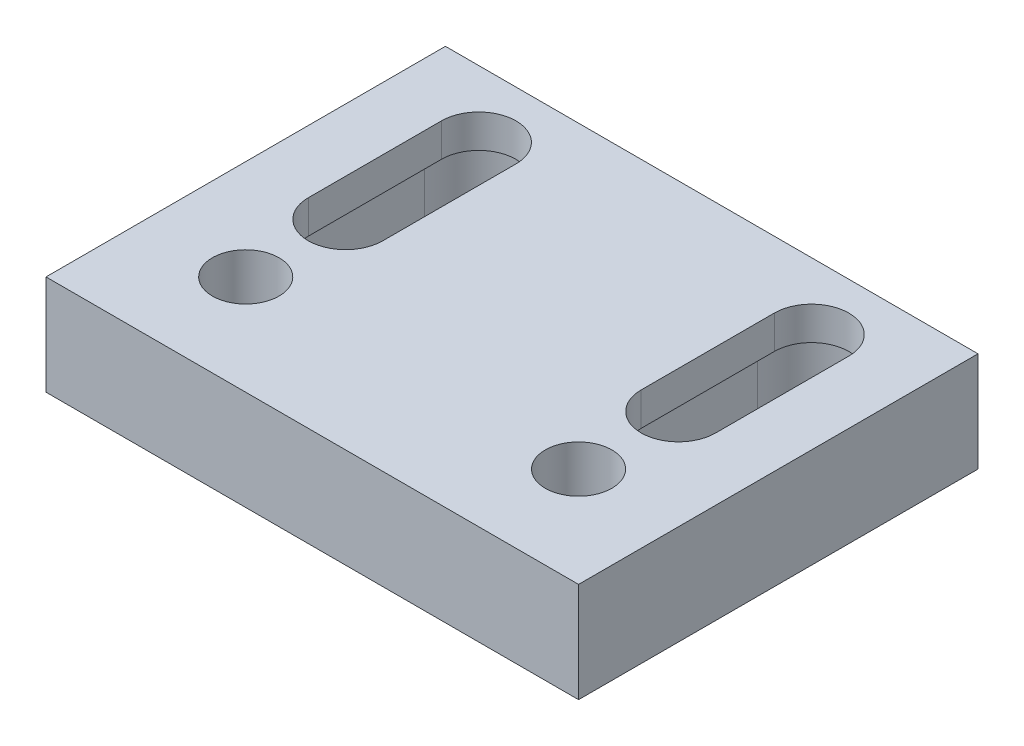
ISO-10303-21;
HEADER;
FILE_DESCRIPTION(('STEP AP214'),'2;1');
FILE_NAME('part.step','',(''),(''),'','','');
FILE_SCHEMA(('AUTOMOTIVE_DESIGN { 1 0 10303 214 1 1 1 1 }'));
ENDSEC;
DATA;
#1=APPLICATION_CONTEXT('core data for automotive mechanical design processes');
#2=APPLICATION_PROTOCOL_DEFINITION('international standard','automotive_design',2000,#1);
#3=PRODUCT_CONTEXT('',#1,'mechanical');
#4=PRODUCT('Part','Part','',(#3));
#5=PRODUCT_RELATED_PRODUCT_CATEGORY('part','',(#4));
#6=PRODUCT_DEFINITION_FORMATION('','',#4);
#7=PRODUCT_DEFINITION_CONTEXT('part definition',#1,'design');
#8=PRODUCT_DEFINITION('design','',#6,#7);
#9=PRODUCT_DEFINITION_SHAPE('','',#8);
#10=(LENGTH_UNIT() NAMED_UNIT(*) SI_UNIT(.MILLI.,.METRE.));
#11=(NAMED_UNIT(*) PLANE_ANGLE_UNIT() SI_UNIT($,.RADIAN.));
#12=(NAMED_UNIT(*) SI_UNIT($,.STERADIAN.) SOLID_ANGLE_UNIT());
#13=UNCERTAINTY_MEASURE_WITH_UNIT(LENGTH_MEASURE(1.E-05),#10,'distance_accuracy_value','');
#14=(GEOMETRIC_REPRESENTATION_CONTEXT(3) GLOBAL_UNCERTAINTY_ASSIGNED_CONTEXT((#13)) GLOBAL_UNIT_ASSIGNED_CONTEXT((#10,
#11,#12)) REPRESENTATION_CONTEXT('',''));
#15=CARTESIAN_POINT('',(0.,0.,0.));
#16=DIRECTION('',(0.,0.,1.));
#17=DIRECTION('',(1.,0.,0.));
#18=AXIS2_PLACEMENT_3D('',#15,#16,#17);
#19=CARTESIAN_POINT('',(0.,19.05,0.));
#20=DIRECTION('',(0.,-1.,0.));
#21=DIRECTION('',(0.,0.,-1.));
#22=AXIS2_PLACEMENT_3D('',#19,#20,#21);
#23=PLANE('',#22);
#24=CARTESIAN_POINT('',(25.4,19.05,-19.05));
#25=DIRECTION('',(0.,1.,0.));
#26=DIRECTION('',(0.,0.,1.));
#27=AXIS2_PLACEMENT_3D('',#24,#25,#26);
#28=CIRCLE('',#27,6.34999999999999);
#29=CARTESIAN_POINT('',(25.4,19.05,-12.7));
#30=VERTEX_POINT('',#29);
#31=EDGE_CURVE('E294',#30,#30,#28,.T.);
#32=ORIENTED_EDGE('',*,*,#31,.F.);
#33=EDGE_LOOP('',(#32));
#34=FACE_BOUND('',#33,.T.);
#35=CARTESIAN_POINT('',(88.9,19.05,-19.05));
#36=DIRECTION('',(0.,1.,0.));
#37=DIRECTION('',(0.,0.,1.));
#38=AXIS2_PLACEMENT_3D('',#35,#36,#37);
#39=CIRCLE('',#38,6.34999999999999);
#40=CARTESIAN_POINT('',(88.9,19.05,-12.7));
#41=VERTEX_POINT('',#40);
#42=EDGE_CURVE('E300',#41,#41,#39,.T.);
#43=ORIENTED_EDGE('',*,*,#42,.F.);
#44=EDGE_LOOP('',(#43));
#45=FACE_BOUND('',#44,.T.);
#46=CARTESIAN_POINT('',(88.9,19.05,-63.5));
#47=DIRECTION('',(0.,1.,0.));
#48=DIRECTION('',(0.,0.,-1.));
#49=AXIS2_PLACEMENT_3D('',#46,#47,#48);
#50=CIRCLE('',#49,7.11200000000001);
#51=CARTESIAN_POINT('',(96.012,19.05,-63.5));
#52=VERTEX_POINT('',#51);
#53=CARTESIAN_POINT('',(81.788,19.05,-63.5));
#54=VERTEX_POINT('',#53);
#55=EDGE_CURVE('E324',#52,#54,#50,.T.);
#56=ORIENTED_EDGE('',*,*,#55,.F.);
#57=DIRECTION('',(0.,0.,-1.));
#58=VECTOR('',#57,1.);
#59=CARTESIAN_POINT('',(96.012,19.05,-63.5));
#60=LINE('',#59,#58);
#61=CARTESIAN_POINT('',(96.012,19.05,-38.1));
#62=VERTEX_POINT('',#61);
#63=EDGE_CURVE('E331',#62,#52,#60,.T.);
#64=ORIENTED_EDGE('',*,*,#63,.F.);
#65=CARTESIAN_POINT('',(88.9,19.05,-38.1));
#66=DIRECTION('',(0.,1.,0.));
#67=DIRECTION('',(0.,0.,-1.));
#68=AXIS2_PLACEMENT_3D('',#65,#66,#67);
#69=CIRCLE('',#68,7.11200000000001);
#70=CARTESIAN_POINT('',(81.788,19.05,-38.1));
#71=VERTEX_POINT('',#70);
#72=EDGE_CURVE('E328',#71,#62,#69,.T.);
#73=ORIENTED_EDGE('',*,*,#72,.F.);
#74=DIRECTION('',(0.,0.,1.));
#75=VECTOR('',#74,1.);
#76=CARTESIAN_POINT('',(81.788,19.05,-63.5));
#77=LINE('',#76,#75);
#78=EDGE_CURVE('E326',#54,#71,#77,.T.);
#79=ORIENTED_EDGE('',*,*,#78,.F.);
#80=EDGE_LOOP('',(#56,#64,#73,#79));
#81=FACE_BOUND('',#80,.T.);
#82=CARTESIAN_POINT('',(25.4,19.05,-63.5));
#83=DIRECTION('',(0.,1.,0.));
#84=DIRECTION('',(0.,0.,1.));
#85=AXIS2_PLACEMENT_3D('',#82,#83,#84);
#86=CIRCLE('',#85,7.11200000000002);
#87=CARTESIAN_POINT('',(32.512,19.05,-63.5));
#88=VERTEX_POINT('',#87);
#89=CARTESIAN_POINT('',(18.288,19.05,-63.5));
#90=VERTEX_POINT('',#89);
#91=EDGE_CURVE('E303',#88,#90,#86,.T.);
#92=ORIENTED_EDGE('',*,*,#91,.F.);
#93=DIRECTION('',(0.,0.,-1.));
#94=VECTOR('',#93,1.);
#95=CARTESIAN_POINT('',(32.512,19.05,-63.5));
#96=LINE('',#95,#94);
#97=CARTESIAN_POINT('',(32.512,19.05,-38.1));
#98=VERTEX_POINT('',#97);
#99=EDGE_CURVE('E310',#98,#88,#96,.T.);
#100=ORIENTED_EDGE('',*,*,#99,.F.);
#101=CARTESIAN_POINT('',(25.4,19.05,-38.1));
#102=DIRECTION('',(0.,1.,0.));
#103=DIRECTION('',(0.,0.,1.));
#104=AXIS2_PLACEMENT_3D('',#101,#102,#103);
#105=CIRCLE('',#104,7.11200000000002);
#106=CARTESIAN_POINT('',(18.288,19.05,-38.1));
#107=VERTEX_POINT('',#106);
#108=EDGE_CURVE('E307',#107,#98,#105,.T.);
#109=ORIENTED_EDGE('',*,*,#108,.F.);
#110=DIRECTION('',(0.,0.,1.));
#111=VECTOR('',#110,1.);
#112=CARTESIAN_POINT('',(18.288,19.05,-63.5));
#113=LINE('',#112,#111);
#114=EDGE_CURVE('E305',#90,#107,#113,.T.);
#115=ORIENTED_EDGE('',*,*,#114,.F.);
#116=EDGE_LOOP('',(#92,#100,#109,#115));
#117=FACE_BOUND('',#116,.T.);
#118=DIRECTION('',(0.,0.,-1.));
#119=VECTOR('',#118,1.);
#120=CARTESIAN_POINT('',(6.35,19.05,0.));
#121=LINE('',#120,#119);
#122=CARTESIAN_POINT('',(6.35,19.05,0.));
#123=VERTEX_POINT('',#122);
#124=CARTESIAN_POINT('',(6.35,19.05,-76.2));
#125=VERTEX_POINT('',#124);
#126=EDGE_CURVE('E68',#123,#125,#121,.T.);
#127=ORIENTED_EDGE('',*,*,#126,.F.);
#128=DIRECTION('',(1.,0.,0.));
#129=VECTOR('',#128,1.);
#130=CARTESIAN_POINT('',(0.,19.05,0.));
#131=LINE('',#130,#129);
#132=CARTESIAN_POINT('',(107.95,19.05,0.));
#133=VERTEX_POINT('',#132);
#134=EDGE_CURVE('E189',#123,#133,#131,.T.);
#135=ORIENTED_EDGE('',*,*,#134,.T.);
#136=DIRECTION('',(0.,0.,1.));
#137=VECTOR('',#136,1.);
#138=CARTESIAN_POINT('',(107.95,19.05,0.));
#139=LINE('',#138,#137);
#140=CARTESIAN_POINT('',(107.95,19.05,-76.2));
#141=VERTEX_POINT('',#140);
#142=EDGE_CURVE('E203',#141,#133,#139,.T.);
#143=ORIENTED_EDGE('',*,*,#142,.F.);
#144=DIRECTION('',(-1.,0.,0.));
#145=VECTOR('',#144,1.);
#146=CARTESIAN_POINT('',(0.,19.05,-76.2));
#147=LINE('',#146,#145);
#148=EDGE_CURVE('E346',#141,#125,#147,.T.);
#149=ORIENTED_EDGE('',*,*,#148,.T.);
#150=EDGE_LOOP('',(#127,#135,#143,#149));
#151=FACE_BOUND('',#150,.T.);
#152=ADVANCED_FACE('F45',(#34,#45,#81,#117,#151),#23,.F.);
#153=CARTESIAN_POINT('',(0.,0.,0.));
#154=DIRECTION('',(0.,-1.,0.));
#155=DIRECTION('',(0.,0.,-1.));
#156=AXIS2_PLACEMENT_3D('',#153,#154,#155);
#157=PLANE('',#156);
#158=CARTESIAN_POINT('',(88.9,0.,-38.1));
#159=DIRECTION('',(0.,-1.,0.));
#160=DIRECTION('',(0.,0.,-1.));
#161=AXIS2_PLACEMENT_3D('',#158,#159,#160);
#162=CIRCLE('',#161,10.3251);
#163=CARTESIAN_POINT('',(99.2251000000001,0.,-38.1));
#164=VERTEX_POINT('',#163);
#165=CARTESIAN_POINT('',(78.5749,0.,-38.1));
#166=VERTEX_POINT('',#165);
#167=EDGE_CURVE('E209',#164,#166,#162,.T.);
#168=ORIENTED_EDGE('',*,*,#167,.F.);
#169=DIRECTION('',(0.,0.,1.));
#170=VECTOR('',#169,1.);
#171=CARTESIAN_POINT('',(99.2251000000001,0.,-38.1));
#172=LINE('',#171,#170);
#173=CARTESIAN_POINT('',(99.2251000000001,0.,-63.5));
#174=VERTEX_POINT('',#173);
#175=EDGE_CURVE('E214',#174,#164,#172,.T.);
#176=ORIENTED_EDGE('',*,*,#175,.F.);
#177=CARTESIAN_POINT('',(88.9,0.,-63.5));
#178=DIRECTION('',(0.,-1.,0.));
#179=DIRECTION('',(0.,0.,-1.));
#180=AXIS2_PLACEMENT_3D('',#177,#178,#179);
#181=CIRCLE('',#180,10.3251);
#182=CARTESIAN_POINT('',(78.5749,0.,-63.5));
#183=VERTEX_POINT('',#182);
#184=EDGE_CURVE('E228',#183,#174,#181,.T.);
#185=ORIENTED_EDGE('',*,*,#184,.F.);
#186=DIRECTION('',(0.,0.,-1.));
#187=VECTOR('',#186,1.);
#188=CARTESIAN_POINT('',(78.5749,0.,-63.5));
#189=LINE('',#188,#187);
#190=EDGE_CURVE('E225',#166,#183,#189,.T.);
#191=ORIENTED_EDGE('',*,*,#190,.F.);
#192=EDGE_LOOP('',(#168,#176,#185,#191));
#193=FACE_BOUND('',#192,.T.);
#194=CARTESIAN_POINT('',(25.4,0.,-63.5));
#195=DIRECTION('',(0.,-1.,0.));
#196=DIRECTION('',(0.,0.,-1.));
#197=AXIS2_PLACEMENT_3D('',#194,#195,#196);
#198=CIRCLE('',#197,10.3251);
#199=CARTESIAN_POINT('',(15.0749,0.,-63.5));
#200=VERTEX_POINT('',#199);
#201=CARTESIAN_POINT('',(35.7251,0.,-63.5));
#202=VERTEX_POINT('',#201);
#203=EDGE_CURVE('E250',#200,#202,#198,.T.);
#204=ORIENTED_EDGE('',*,*,#203,.F.);
#205=DIRECTION('',(0.,0.,-1.));
#206=VECTOR('',#205,1.);
#207=CARTESIAN_POINT('',(15.0749,0.,-63.5));
#208=LINE('',#207,#206);
#209=CARTESIAN_POINT('',(15.0749,0.,-38.1));
#210=VERTEX_POINT('',#209);
#211=EDGE_CURVE('E255',#210,#200,#208,.T.);
#212=ORIENTED_EDGE('',*,*,#211,.F.);
#213=CARTESIAN_POINT('',(25.4,0.,-38.1));
#214=DIRECTION('',(0.,-1.,0.));
#215=DIRECTION('',(0.,0.,-1.));
#216=AXIS2_PLACEMENT_3D('',#213,#214,#215);
#217=CIRCLE('',#216,10.3251);
#218=CARTESIAN_POINT('',(35.7251,0.,-38.1));
#219=VERTEX_POINT('',#218);
#220=EDGE_CURVE('E269',#219,#210,#217,.T.);
#221=ORIENTED_EDGE('',*,*,#220,.F.);
#222=DIRECTION('',(0.,0.,1.));
#223=VECTOR('',#222,1.);
#224=CARTESIAN_POINT('',(35.7251,0.,-38.1));
#225=LINE('',#224,#223);
#226=EDGE_CURVE('E266',#202,#219,#225,.T.);
#227=ORIENTED_EDGE('',*,*,#226,.F.);
#228=EDGE_LOOP('',(#204,#212,#221,#227));
#229=FACE_BOUND('',#228,.T.);
#230=CARTESIAN_POINT('',(25.4,0.,-19.05));
#231=DIRECTION('',(0.,1.,0.));
#232=DIRECTION('',(0.,0.,1.));
#233=AXIS2_PLACEMENT_3D('',#230,#231,#232);
#234=CIRCLE('',#233,6.34999999999999);
#235=CARTESIAN_POINT('',(25.4,0.,-12.7));
#236=VERTEX_POINT('',#235);
#237=EDGE_CURVE('E291',#236,#236,#234,.T.);
#238=ORIENTED_EDGE('',*,*,#237,.T.);
#239=EDGE_LOOP('',(#238));
#240=FACE_BOUND('',#239,.T.);
#241=CARTESIAN_POINT('',(88.9,0.,-19.05));
#242=DIRECTION('',(0.,1.,0.));
#243=DIRECTION('',(0.,0.,1.));
#244=AXIS2_PLACEMENT_3D('',#241,#242,#243);
#245=CIRCLE('',#244,6.34999999999998);
#246=CARTESIAN_POINT('',(88.9,0.,-12.7));
#247=VERTEX_POINT('',#246);
#248=EDGE_CURVE('E297',#247,#247,#245,.T.);
#249=ORIENTED_EDGE('',*,*,#248,.T.);
#250=EDGE_LOOP('',(#249));
#251=FACE_BOUND('',#250,.T.);
#252=DIRECTION('',(1.,0.,0.));
#253=VECTOR('',#252,1.);
#254=CARTESIAN_POINT('',(0.,0.,0.));
#255=LINE('',#254,#253);
#256=CARTESIAN_POINT('',(6.35,0.,0.));
#257=VERTEX_POINT('',#256);
#258=CARTESIAN_POINT('',(107.95,0.,0.));
#259=VERTEX_POINT('',#258);
#260=EDGE_CURVE('E190',#257,#259,#255,.T.);
#261=ORIENTED_EDGE('',*,*,#260,.F.);
#262=DIRECTION('',(0.,0.,-1.));
#263=VECTOR('',#262,1.);
#264=CARTESIAN_POINT('',(6.35,0.,0.));
#265=LINE('',#264,#263);
#266=CARTESIAN_POINT('',(6.35,0.,-76.2));
#267=VERTEX_POINT('',#266);
#268=EDGE_CURVE('E193',#257,#267,#265,.T.);
#269=ORIENTED_EDGE('',*,*,#268,.T.);
#270=DIRECTION('',(-1.,0.,0.));
#271=VECTOR('',#270,1.);
#272=CARTESIAN_POINT('',(0.,0.,-76.2));
#273=LINE('',#272,#271);
#274=CARTESIAN_POINT('',(107.95,0.,-76.2));
#275=VERTEX_POINT('',#274);
#276=EDGE_CURVE('E182',#275,#267,#273,.T.);
#277=ORIENTED_EDGE('',*,*,#276,.F.);
#278=DIRECTION('',(0.,0.,1.));
#279=VECTOR('',#278,1.);
#280=CARTESIAN_POINT('',(107.95,0.,0.));
#281=LINE('',#280,#279);
#282=EDGE_CURVE('E199',#275,#259,#281,.T.);
#283=ORIENTED_EDGE('',*,*,#282,.T.);
#284=EDGE_LOOP('',(#261,#269,#277,#283));
#285=FACE_BOUND('',#284,.T.);
#286=ADVANCED_FACE('F194',(#193,#229,#240,#251,#285),#157,.T.);
#287=CARTESIAN_POINT('',(0.,19.05,0.));
#288=DIRECTION('',(0.,0.,-1.));
#289=DIRECTION('',(-1.,0.,0.));
#290=AXIS2_PLACEMENT_3D('',#287,#288,#289);
#291=PLANE('',#290);
#292=DIRECTION('',(0.,1.,0.));
#293=VECTOR('',#292,1.);
#294=CARTESIAN_POINT('',(6.35,19.05,0.));
#295=LINE('',#294,#293);
#296=EDGE_CURVE('E60',#257,#123,#295,.T.);
#297=ORIENTED_EDGE('',*,*,#296,.F.);
#298=ORIENTED_EDGE('',*,*,#260,.T.);
#299=DIRECTION('',(0.,-1.,0.));
#300=VECTOR('',#299,1.);
#301=CARTESIAN_POINT('',(107.95,19.05,0.));
#302=LINE('',#301,#300);
#303=EDGE_CURVE('E206',#133,#259,#302,.T.);
#304=ORIENTED_EDGE('',*,*,#303,.F.);
#305=ORIENTED_EDGE('',*,*,#134,.F.);
#306=EDGE_LOOP('',(#297,#298,#304,#305));
#307=FACE_BOUND('',#306,.T.);
#308=ADVANCED_FACE('F47',(#307),#291,.F.);
#309=CARTESIAN_POINT('',(0.,19.05,-76.2));
#310=DIRECTION('',(0.,0.,1.));
#311=DIRECTION('',(1.,0.,0.));
#312=AXIS2_PLACEMENT_3D('',#309,#310,#311);
#313=PLANE('',#312);
#314=DIRECTION('',(0.,-1.,0.));
#315=VECTOR('',#314,1.);
#316=CARTESIAN_POINT('',(6.35,19.05,-76.2));
#317=LINE('',#316,#315);
#318=EDGE_CURVE('E13',#125,#267,#317,.T.);
#319=ORIENTED_EDGE('',*,*,#318,.F.);
#320=ORIENTED_EDGE('',*,*,#148,.F.);
#321=DIRECTION('',(0.,1.,0.));
#322=VECTOR('',#321,1.);
#323=CARTESIAN_POINT('',(107.95,19.05,-76.2));
#324=LINE('',#323,#322);
#325=EDGE_CURVE('E53',#275,#141,#324,.T.);
#326=ORIENTED_EDGE('',*,*,#325,.F.);
#327=ORIENTED_EDGE('',*,*,#276,.T.);
#328=EDGE_LOOP('',(#319,#320,#326,#327));
#329=FACE_BOUND('',#328,.T.);
#330=ADVANCED_FACE('F184',(#329),#313,.F.);
#331=CARTESIAN_POINT('',(88.9,19.05,-63.5));
#332=DIRECTION('',(0.,-1.,0.));
#333=DIRECTION('',(0.,0.,-1.));
#334=AXIS2_PLACEMENT_3D('',#331,#332,#333);
#335=CYLINDRICAL_SURFACE('',#334,7.11200000000001);
#336=DIRECTION('',(0.,-1.,0.));
#337=VECTOR('',#336,1.);
#338=CARTESIAN_POINT('',(81.788,19.05,-63.5));
#339=LINE('',#338,#337);
#340=CARTESIAN_POINT('',(81.788,12.7,-63.5));
#341=VERTEX_POINT('',#340);
#342=EDGE_CURVE('E342',#54,#341,#339,.T.);
#343=ORIENTED_EDGE('',*,*,#342,.T.);
#344=CARTESIAN_POINT('',(88.9,12.7,-63.5));
#345=DIRECTION('',(0.,-1.,0.));
#346=DIRECTION('',(0.,0.,-1.));
#347=AXIS2_PLACEMENT_3D('',#344,#345,#346);
#348=CIRCLE('',#347,7.11200000000001);
#349=CARTESIAN_POINT('',(96.012,12.7,-63.5));
#350=VERTEX_POINT('',#349);
#351=EDGE_CURVE('E247',#341,#350,#348,.T.);
#352=ORIENTED_EDGE('',*,*,#351,.T.);
#353=DIRECTION('',(0.,-1.,0.));
#354=VECTOR('',#353,1.);
#355=CARTESIAN_POINT('',(96.012,19.05,-63.5));
#356=LINE('',#355,#354);
#357=EDGE_CURVE('E333',#52,#350,#356,.T.);
#358=ORIENTED_EDGE('',*,*,#357,.F.);
#359=ORIENTED_EDGE('',*,*,#55,.T.);
#360=EDGE_LOOP('',(#343,#352,#358,#359));
#361=FACE_BOUND('',#360,.T.);
#362=ADVANCED_FACE('F369',(#361),#335,.F.);
#363=CARTESIAN_POINT('',(81.788,19.05,-63.5));
#364=DIRECTION('',(1.,0.,0.));
#365=DIRECTION('',(0.,0.,-1.));
#366=AXIS2_PLACEMENT_3D('',#363,#364,#365);
#367=PLANE('',#366);
#368=DIRECTION('',(0.,-1.,0.));
#369=VECTOR('',#368,1.);
#370=CARTESIAN_POINT('',(81.788,19.05,-38.1));
#371=LINE('',#370,#369);
#372=CARTESIAN_POINT('',(81.788,12.7,-38.1));
#373=VERTEX_POINT('',#372);
#374=EDGE_CURVE('E339',#71,#373,#371,.T.);
#375=ORIENTED_EDGE('',*,*,#374,.T.);
#376=DIRECTION('',(0.,0.,-1.));
#377=VECTOR('',#376,1.);
#378=CARTESIAN_POINT('',(81.788,12.7,-63.5));
#379=LINE('',#378,#377);
#380=EDGE_CURVE('E244',#373,#341,#379,.T.);
#381=ORIENTED_EDGE('',*,*,#380,.T.);
#382=ORIENTED_EDGE('',*,*,#342,.F.);
#383=ORIENTED_EDGE('',*,*,#78,.T.);
#384=EDGE_LOOP('',(#375,#381,#382,#383));
#385=FACE_BOUND('',#384,.T.);
#386=ADVANCED_FACE('F376',(#385),#367,.T.);
#387=CARTESIAN_POINT('',(88.9,19.05,-38.1));
#388=DIRECTION('',(0.,-1.,0.));
#389=DIRECTION('',(0.,0.,-1.));
#390=AXIS2_PLACEMENT_3D('',#387,#388,#389);
#391=CYLINDRICAL_SURFACE('',#390,7.11200000000001);
#392=DIRECTION('',(0.,-1.,0.));
#393=VECTOR('',#392,1.);
#394=CARTESIAN_POINT('',(96.012,19.05,-38.1));
#395=LINE('',#394,#393);
#396=CARTESIAN_POINT('',(96.012,12.7,-38.1));
#397=VERTEX_POINT('',#396);
#398=EDGE_CURVE('E336',#62,#397,#395,.T.);
#399=ORIENTED_EDGE('',*,*,#398,.T.);
#400=CARTESIAN_POINT('',(88.9,12.7,-38.1));
#401=DIRECTION('',(0.,-1.,0.));
#402=DIRECTION('',(0.,0.,-1.));
#403=AXIS2_PLACEMENT_3D('',#400,#401,#402);
#404=CIRCLE('',#403,7.11200000000001);
#405=EDGE_CURVE('E235',#397,#373,#404,.T.);
#406=ORIENTED_EDGE('',*,*,#405,.T.);
#407=ORIENTED_EDGE('',*,*,#374,.F.);
#408=ORIENTED_EDGE('',*,*,#72,.T.);
#409=EDGE_LOOP('',(#399,#406,#407,#408));
#410=FACE_BOUND('',#409,.T.);
#411=ADVANCED_FACE('F463',(#410),#391,.F.);
#412=CARTESIAN_POINT('',(96.012,19.05,-63.5));
#413=DIRECTION('',(-1.,0.,0.));
#414=DIRECTION('',(0.,0.,1.));
#415=AXIS2_PLACEMENT_3D('',#412,#413,#414);
#416=PLANE('',#415);
#417=ORIENTED_EDGE('',*,*,#357,.T.);
#418=DIRECTION('',(0.,0.,1.));
#419=VECTOR('',#418,1.);
#420=CARTESIAN_POINT('',(96.012,12.7,-63.5));
#421=LINE('',#420,#419);
#422=EDGE_CURVE('E352',#350,#397,#421,.T.);
#423=ORIENTED_EDGE('',*,*,#422,.T.);
#424=ORIENTED_EDGE('',*,*,#398,.F.);
#425=ORIENTED_EDGE('',*,*,#63,.T.);
#426=EDGE_LOOP('',(#417,#423,#424,#425));
#427=FACE_BOUND('',#426,.T.);
#428=ADVANCED_FACE('F457',(#427),#416,.T.);
#429=CARTESIAN_POINT('',(25.4,19.05,-63.5));
#430=DIRECTION('',(0.,-1.,0.));
#431=DIRECTION('',(0.,0.,-1.));
#432=AXIS2_PLACEMENT_3D('',#429,#430,#431);
#433=CYLINDRICAL_SURFACE('',#432,7.11200000000002);
#434=DIRECTION('',(0.,-1.,0.));
#435=VECTOR('',#434,1.);
#436=CARTESIAN_POINT('',(18.288,19.05,-63.5));
#437=LINE('',#436,#435);
#438=CARTESIAN_POINT('',(18.288,12.7,-63.5));
#439=VERTEX_POINT('',#438);
#440=EDGE_CURVE('E321',#90,#439,#437,.T.);
#441=ORIENTED_EDGE('',*,*,#440,.T.);
#442=CARTESIAN_POINT('',(25.4,12.7,-63.5));
#443=DIRECTION('',(0.,-1.,0.));
#444=DIRECTION('',(0.,0.,-1.));
#445=AXIS2_PLACEMENT_3D('',#442,#443,#444);
#446=CIRCLE('',#445,7.11200000000002);
#447=CARTESIAN_POINT('',(32.512,12.7,-63.5));
#448=VERTEX_POINT('',#447);
#449=EDGE_CURVE('E288',#439,#448,#446,.T.);
#450=ORIENTED_EDGE('',*,*,#449,.T.);
#451=DIRECTION('',(0.,-1.,0.));
#452=VECTOR('',#451,1.);
#453=CARTESIAN_POINT('',(32.512,19.05,-63.5));
#454=LINE('',#453,#452);
#455=EDGE_CURVE('E312',#88,#448,#454,.T.);
#456=ORIENTED_EDGE('',*,*,#455,.F.);
#457=ORIENTED_EDGE('',*,*,#91,.T.);
#458=EDGE_LOOP('',(#441,#450,#456,#457));
#459=FACE_BOUND('',#458,.T.);
#460=ADVANCED_FACE('F462',(#459),#433,.F.);
#461=CARTESIAN_POINT('',(18.288,19.05,-63.5));
#462=DIRECTION('',(1.,0.,0.));
#463=DIRECTION('',(0.,0.,-1.));
#464=AXIS2_PLACEMENT_3D('',#461,#462,#463);
#465=PLANE('',#464);
#466=DIRECTION('',(0.,-1.,0.));
#467=VECTOR('',#466,1.);
#468=CARTESIAN_POINT('',(18.288,19.05,-38.1));
#469=LINE('',#468,#467);
#470=CARTESIAN_POINT('',(18.288,12.7,-38.1));
#471=VERTEX_POINT('',#470);
#472=EDGE_CURVE('E318',#107,#471,#469,.T.);
#473=ORIENTED_EDGE('',*,*,#472,.T.);
#474=DIRECTION('',(0.,0.,-1.));
#475=VECTOR('',#474,1.);
#476=CARTESIAN_POINT('',(18.288,12.7,-63.5));
#477=LINE('',#476,#475);
#478=EDGE_CURVE('E285',#471,#439,#477,.T.);
#479=ORIENTED_EDGE('',*,*,#478,.T.);
#480=ORIENTED_EDGE('',*,*,#440,.F.);
#481=ORIENTED_EDGE('',*,*,#114,.T.);
#482=EDGE_LOOP('',(#473,#479,#480,#481));
#483=FACE_BOUND('',#482,.T.);
#484=ADVANCED_FACE('F561',(#483),#465,.T.);
#485=CARTESIAN_POINT('',(25.4,19.05,-38.1));
#486=DIRECTION('',(0.,-1.,0.));
#487=DIRECTION('',(0.,0.,-1.));
#488=AXIS2_PLACEMENT_3D('',#485,#486,#487);
#489=CYLINDRICAL_SURFACE('',#488,7.11200000000002);
#490=DIRECTION('',(0.,-1.,0.));
#491=VECTOR('',#490,1.);
#492=CARTESIAN_POINT('',(32.512,19.05,-38.1));
#493=LINE('',#492,#491);
#494=CARTESIAN_POINT('',(32.512,12.7,-38.1));
#495=VERTEX_POINT('',#494);
#496=EDGE_CURVE('E315',#98,#495,#493,.T.);
#497=ORIENTED_EDGE('',*,*,#496,.T.);
#498=CARTESIAN_POINT('',(25.4,12.7,-38.1));
#499=DIRECTION('',(0.,-1.,0.));
#500=DIRECTION('',(0.,0.,-1.));
#501=AXIS2_PLACEMENT_3D('',#498,#499,#500);
#502=CIRCLE('',#501,7.11200000000002);
#503=EDGE_CURVE('E276',#495,#471,#502,.T.);
#504=ORIENTED_EDGE('',*,*,#503,.T.);
#505=ORIENTED_EDGE('',*,*,#472,.F.);
#506=ORIENTED_EDGE('',*,*,#108,.T.);
#507=EDGE_LOOP('',(#497,#504,#505,#506));
#508=FACE_BOUND('',#507,.T.);
#509=ADVANCED_FACE('F549',(#508),#489,.F.);
#510=CARTESIAN_POINT('',(32.512,19.05,-63.5));
#511=DIRECTION('',(-1.,0.,0.));
#512=DIRECTION('',(0.,0.,1.));
#513=AXIS2_PLACEMENT_3D('',#510,#511,#512);
#514=PLANE('',#513);
#515=ORIENTED_EDGE('',*,*,#455,.T.);
#516=DIRECTION('',(0.,0.,1.));
#517=VECTOR('',#516,1.);
#518=CARTESIAN_POINT('',(32.512,12.7,-63.5));
#519=LINE('',#518,#517);
#520=EDGE_CURVE('E348',#448,#495,#519,.T.);
#521=ORIENTED_EDGE('',*,*,#520,.T.);
#522=ORIENTED_EDGE('',*,*,#496,.F.);
#523=ORIENTED_EDGE('',*,*,#99,.T.);
#524=EDGE_LOOP('',(#515,#521,#522,#523));
#525=FACE_BOUND('',#524,.T.);
#526=ADVANCED_FACE('F543',(#525),#514,.T.);
#527=CARTESIAN_POINT('',(88.9,19.05,-19.05));
#528=DIRECTION('',(0.,1.,0.));
#529=DIRECTION('',(0.,0.,1.));
#530=AXIS2_PLACEMENT_3D('',#527,#528,#529);
#531=CYLINDRICAL_SURFACE('',#530,6.34999999999999);
#532=ORIENTED_EDGE('',*,*,#248,.F.);
#533=EDGE_LOOP('',(#532));
#534=FACE_BOUND('',#533,.T.);
#535=ORIENTED_EDGE('',*,*,#42,.T.);
#536=EDGE_LOOP('',(#535));
#537=FACE_BOUND('',#536,.T.);
#538=ADVANCED_FACE('F548',(#534,#537),#531,.F.);
#539=CARTESIAN_POINT('',(25.4,19.05,-19.05));
#540=DIRECTION('',(0.,1.,0.));
#541=DIRECTION('',(0.,0.,1.));
#542=AXIS2_PLACEMENT_3D('',#539,#540,#541);
#543=CYLINDRICAL_SURFACE('',#542,6.34999999999999);
#544=ORIENTED_EDGE('',*,*,#237,.F.);
#545=EDGE_LOOP('',(#544));
#546=FACE_BOUND('',#545,.T.);
#547=ORIENTED_EDGE('',*,*,#31,.T.);
#548=EDGE_LOOP('',(#547));
#549=FACE_BOUND('',#548,.T.);
#550=ADVANCED_FACE('F535',(#546,#549),#543,.F.);
#551=CARTESIAN_POINT('',(25.4,12.7,-63.5));
#552=DIRECTION('',(0.,-1.,0.));
#553=DIRECTION('',(0.,0.,-1.));
#554=AXIS2_PLACEMENT_3D('',#551,#552,#553);
#555=CYLINDRICAL_SURFACE('',#554,10.3251);
#556=ORIENTED_EDGE('',*,*,#203,.T.);
#557=DIRECTION('',(0.,-1.,0.));
#558=VECTOR('',#557,1.);
#559=CARTESIAN_POINT('',(35.7251,12.7,-63.5));
#560=LINE('',#559,#558);
#561=CARTESIAN_POINT('',(35.7251,12.7,-63.5));
#562=VERTEX_POINT('',#561);
#563=EDGE_CURVE('E264',#562,#202,#560,.T.);
#564=ORIENTED_EDGE('',*,*,#563,.F.);
#565=CARTESIAN_POINT('',(25.4,12.7,-63.5));
#566=DIRECTION('',(0.,-1.,0.));
#567=DIRECTION('',(0.,0.,-1.));
#568=AXIS2_PLACEMENT_3D('',#565,#566,#567);
#569=CIRCLE('',#568,10.3251);
#570=CARTESIAN_POINT('',(15.0749,12.7,-63.5));
#571=VERTEX_POINT('',#570);
#572=EDGE_CURVE('E251',#571,#562,#569,.T.);
#573=ORIENTED_EDGE('',*,*,#572,.F.);
#574=DIRECTION('',(0.,-1.,0.));
#575=VECTOR('',#574,1.);
#576=CARTESIAN_POINT('',(15.0749,12.7,-63.5));
#577=LINE('',#576,#575);
#578=EDGE_CURVE('E274',#571,#200,#577,.T.);
#579=ORIENTED_EDGE('',*,*,#578,.T.);
#580=EDGE_LOOP('',(#556,#564,#573,#579));
#581=FACE_BOUND('',#580,.T.);
#582=ADVANCED_FACE('F525',(#581),#555,.F.);
#583=CARTESIAN_POINT('',(15.0749,12.7,-63.5));
#584=DIRECTION('',(-1.,0.,0.));
#585=DIRECTION('',(0.,0.,1.));
#586=AXIS2_PLACEMENT_3D('',#583,#584,#585);
#587=PLANE('',#586);
#588=ORIENTED_EDGE('',*,*,#211,.T.);
#589=ORIENTED_EDGE('',*,*,#578,.F.);
#590=DIRECTION('',(0.,0.,-1.));
#591=VECTOR('',#590,1.);
#592=CARTESIAN_POINT('',(15.0749,12.7,-63.5));
#593=LINE('',#592,#591);
#594=CARTESIAN_POINT('',(15.0749,12.7,-38.1));
#595=VERTEX_POINT('',#594);
#596=EDGE_CURVE('E261',#595,#571,#593,.T.);
#597=ORIENTED_EDGE('',*,*,#596,.F.);
#598=DIRECTION('',(0.,-1.,0.));
#599=VECTOR('',#598,1.);
#600=CARTESIAN_POINT('',(15.0749,12.7,-38.1));
#601=LINE('',#600,#599);
#602=EDGE_CURVE('E277',#595,#210,#601,.T.);
#603=ORIENTED_EDGE('',*,*,#602,.T.);
#604=EDGE_LOOP('',(#588,#589,#597,#603));
#605=FACE_BOUND('',#604,.T.);
#606=ADVANCED_FACE('F515',(#605),#587,.F.);
#607=CARTESIAN_POINT('',(25.4,12.7,-38.1));
#608=DIRECTION('',(0.,-1.,0.));
#609=DIRECTION('',(0.,0.,-1.));
#610=AXIS2_PLACEMENT_3D('',#607,#608,#609);
#611=CYLINDRICAL_SURFACE('',#610,10.3251);
#612=ORIENTED_EDGE('',*,*,#220,.T.);
#613=ORIENTED_EDGE('',*,*,#602,.F.);
#614=CARTESIAN_POINT('',(25.4,12.7,-38.1));
#615=DIRECTION('',(0.,-1.,0.));
#616=DIRECTION('',(0.,0.,-1.));
#617=AXIS2_PLACEMENT_3D('',#614,#615,#616);
#618=CIRCLE('',#617,10.3251);
#619=CARTESIAN_POINT('',(35.7251,12.7,-38.1));
#620=VERTEX_POINT('',#619);
#621=EDGE_CURVE('E258',#620,#595,#618,.T.);
#622=ORIENTED_EDGE('',*,*,#621,.F.);
#623=DIRECTION('',(0.,-1.,0.));
#624=VECTOR('',#623,1.);
#625=CARTESIAN_POINT('',(35.7251,12.7,-38.1));
#626=LINE('',#625,#624);
#627=EDGE_CURVE('E279',#620,#219,#626,.T.);
#628=ORIENTED_EDGE('',*,*,#627,.T.);
#629=EDGE_LOOP('',(#612,#613,#622,#628));
#630=FACE_BOUND('',#629,.T.);
#631=ADVANCED_FACE('F505',(#630),#611,.F.);
#632=CARTESIAN_POINT('',(35.7251,12.7,-38.1));
#633=DIRECTION('',(1.,0.,0.));
#634=DIRECTION('',(0.,0.,-1.));
#635=AXIS2_PLACEMENT_3D('',#632,#633,#634);
#636=PLANE('',#635);
#637=ORIENTED_EDGE('',*,*,#226,.T.);
#638=ORIENTED_EDGE('',*,*,#627,.F.);
#639=DIRECTION('',(0.,0.,1.));
#640=VECTOR('',#639,1.);
#641=CARTESIAN_POINT('',(35.7251,12.7,-38.1));
#642=LINE('',#641,#640);
#643=EDGE_CURVE('E254',#562,#620,#642,.T.);
#644=ORIENTED_EDGE('',*,*,#643,.F.);
#645=ORIENTED_EDGE('',*,*,#563,.T.);
#646=EDGE_LOOP('',(#637,#638,#644,#645));
#647=FACE_BOUND('',#646,.T.);
#648=ADVANCED_FACE('F495',(#647),#636,.F.);
#649=CARTESIAN_POINT('',(25.4,12.7,-63.5));
#650=DIRECTION('',(0.,-1.,0.));
#651=DIRECTION('',(0.,0.,-1.));
#652=AXIS2_PLACEMENT_3D('',#649,#650,#651);
#653=PLANE('',#652);
#654=ORIENTED_EDGE('',*,*,#478,.F.);
#655=ORIENTED_EDGE('',*,*,#503,.F.);
#656=ORIENTED_EDGE('',*,*,#520,.F.);
#657=ORIENTED_EDGE('',*,*,#449,.F.);
#658=EDGE_LOOP('',(#654,#655,#656,#657));
#659=FACE_BOUND('',#658,.T.);
#660=ORIENTED_EDGE('',*,*,#572,.T.);
#661=ORIENTED_EDGE('',*,*,#643,.T.);
#662=ORIENTED_EDGE('',*,*,#621,.T.);
#663=ORIENTED_EDGE('',*,*,#596,.T.);
#664=EDGE_LOOP('',(#660,#661,#662,#663));
#665=FACE_BOUND('',#664,.T.);
#666=ADVANCED_FACE('F449',(#659,#665),#653,.T.);
#667=CARTESIAN_POINT('',(88.9,12.7,-38.1));
#668=DIRECTION('',(0.,-1.,0.));
#669=DIRECTION('',(0.,0.,-1.));
#670=AXIS2_PLACEMENT_3D('',#667,#668,#669);
#671=CYLINDRICAL_SURFACE('',#670,10.3251);
#672=ORIENTED_EDGE('',*,*,#167,.T.);
#673=DIRECTION('',(0.,-1.,0.));
#674=VECTOR('',#673,1.);
#675=CARTESIAN_POINT('',(78.5749,12.7,-38.1));
#676=LINE('',#675,#674);
#677=CARTESIAN_POINT('',(78.5749,12.7,-38.1));
#678=VERTEX_POINT('',#677);
#679=EDGE_CURVE('E223',#678,#166,#676,.T.);
#680=ORIENTED_EDGE('',*,*,#679,.F.);
#681=CARTESIAN_POINT('',(88.9,12.7,-38.1));
#682=DIRECTION('',(0.,-1.,0.));
#683=DIRECTION('',(0.,0.,-1.));
#684=AXIS2_PLACEMENT_3D('',#681,#682,#683);
#685=CIRCLE('',#684,10.3251);
#686=CARTESIAN_POINT('',(99.2251000000001,12.7,-38.1));
#687=VERTEX_POINT('',#686);
#688=EDGE_CURVE('E210',#687,#678,#685,.T.);
#689=ORIENTED_EDGE('',*,*,#688,.F.);
#690=DIRECTION('',(0.,-1.,0.));
#691=VECTOR('',#690,1.);
#692=CARTESIAN_POINT('',(99.2251000000001,12.7,-38.1));
#693=LINE('',#692,#691);
#694=EDGE_CURVE('E233',#687,#164,#693,.T.);
#695=ORIENTED_EDGE('',*,*,#694,.T.);
#696=EDGE_LOOP('',(#672,#680,#689,#695));
#697=FACE_BOUND('',#696,.T.);
#698=ADVANCED_FACE('F439',(#697),#671,.F.);
#699=CARTESIAN_POINT('',(99.2251000000001,12.7,-38.1));
#700=DIRECTION('',(1.,0.,0.));
#701=DIRECTION('',(0.,0.,-1.));
#702=AXIS2_PLACEMENT_3D('',#699,#700,#701);
#703=PLANE('',#702);
#704=ORIENTED_EDGE('',*,*,#175,.T.);
#705=ORIENTED_EDGE('',*,*,#694,.F.);
#706=DIRECTION('',(0.,0.,1.));
#707=VECTOR('',#706,1.);
#708=CARTESIAN_POINT('',(99.2251000000001,12.7,-38.1));
#709=LINE('',#708,#707);
#710=CARTESIAN_POINT('',(99.2251000000001,12.7,-63.5));
#711=VERTEX_POINT('',#710);
#712=EDGE_CURVE('E220',#711,#687,#709,.T.);
#713=ORIENTED_EDGE('',*,*,#712,.F.);
#714=DIRECTION('',(0.,-1.,0.));
#715=VECTOR('',#714,1.);
#716=CARTESIAN_POINT('',(99.2251000000001,12.7,-63.5));
#717=LINE('',#716,#715);
#718=EDGE_CURVE('E236',#711,#174,#717,.T.);
#719=ORIENTED_EDGE('',*,*,#718,.T.);
#720=EDGE_LOOP('',(#704,#705,#713,#719));
#721=FACE_BOUND('',#720,.T.);
#722=ADVANCED_FACE('F429',(#721),#703,.F.);
#723=CARTESIAN_POINT('',(88.9,12.7,-63.5));
#724=DIRECTION('',(0.,-1.,0.));
#725=DIRECTION('',(0.,0.,-1.));
#726=AXIS2_PLACEMENT_3D('',#723,#724,#725);
#727=CYLINDRICAL_SURFACE('',#726,10.3251);
#728=ORIENTED_EDGE('',*,*,#184,.T.);
#729=ORIENTED_EDGE('',*,*,#718,.F.);
#730=CARTESIAN_POINT('',(88.9,12.7,-63.5));
#731=DIRECTION('',(0.,-1.,0.));
#732=DIRECTION('',(0.,0.,-1.));
#733=AXIS2_PLACEMENT_3D('',#730,#731,#732);
#734=CIRCLE('',#733,10.3251);
#735=CARTESIAN_POINT('',(78.5749,12.7,-63.5));
#736=VERTEX_POINT('',#735);
#737=EDGE_CURVE('E217',#736,#711,#734,.T.);
#738=ORIENTED_EDGE('',*,*,#737,.F.);
#739=DIRECTION('',(0.,-1.,0.));
#740=VECTOR('',#739,1.);
#741=CARTESIAN_POINT('',(78.5749,12.7,-63.5));
#742=LINE('',#741,#740);
#743=EDGE_CURVE('E238',#736,#183,#742,.T.);
#744=ORIENTED_EDGE('',*,*,#743,.T.);
#745=EDGE_LOOP('',(#728,#729,#738,#744));
#746=FACE_BOUND('',#745,.T.);
#747=ADVANCED_FACE('F419',(#746),#727,.F.);
#748=CARTESIAN_POINT('',(78.5749,12.7,-63.5));
#749=DIRECTION('',(-1.,0.,0.));
#750=DIRECTION('',(0.,0.,1.));
#751=AXIS2_PLACEMENT_3D('',#748,#749,#750);
#752=PLANE('',#751);
#753=ORIENTED_EDGE('',*,*,#190,.T.);
#754=ORIENTED_EDGE('',*,*,#743,.F.);
#755=DIRECTION('',(0.,0.,-1.));
#756=VECTOR('',#755,1.);
#757=CARTESIAN_POINT('',(78.5749,12.7,-63.5));
#758=LINE('',#757,#756);
#759=EDGE_CURVE('E213',#678,#736,#758,.T.);
#760=ORIENTED_EDGE('',*,*,#759,.F.);
#761=ORIENTED_EDGE('',*,*,#679,.T.);
#762=EDGE_LOOP('',(#753,#754,#760,#761));
#763=FACE_BOUND('',#762,.T.);
#764=ADVANCED_FACE('F409',(#763),#752,.F.);
#765=CARTESIAN_POINT('',(88.9,12.7,-38.1));
#766=DIRECTION('',(0.,-1.,0.));
#767=DIRECTION('',(0.,0.,-1.));
#768=AXIS2_PLACEMENT_3D('',#765,#766,#767);
#769=PLANE('',#768);
#770=ORIENTED_EDGE('',*,*,#380,.F.);
#771=ORIENTED_EDGE('',*,*,#405,.F.);
#772=ORIENTED_EDGE('',*,*,#422,.F.);
#773=ORIENTED_EDGE('',*,*,#351,.F.);
#774=EDGE_LOOP('',(#770,#771,#772,#773));
#775=FACE_BOUND('',#774,.T.);
#776=ORIENTED_EDGE('',*,*,#688,.T.);
#777=ORIENTED_EDGE('',*,*,#759,.T.);
#778=ORIENTED_EDGE('',*,*,#737,.T.);
#779=ORIENTED_EDGE('',*,*,#712,.T.);
#780=EDGE_LOOP('',(#776,#777,#778,#779));
#781=FACE_BOUND('',#780,.T.);
#782=ADVANCED_FACE('F398',(#775,#781),#769,.T.);
#783=CARTESIAN_POINT('',(107.95,-189.232616738492,15.9678186767664));
#784=DIRECTION('',(1.,0.,0.));
#785=DIRECTION('',(0.,0.,-1.));
#786=AXIS2_PLACEMENT_3D('',#783,#784,#785);
#787=PLANE('',#786);
#788=ORIENTED_EDGE('',*,*,#142,.T.);
#789=ORIENTED_EDGE('',*,*,#303,.T.);
#790=ORIENTED_EDGE('',*,*,#282,.F.);
#791=ORIENTED_EDGE('',*,*,#325,.T.);
#792=EDGE_LOOP('',(#788,#789,#790,#791));
#793=FACE_BOUND('',#792,.T.);
#794=ADVANCED_FACE('F355',(#793),#787,.T.);
#795=CARTESIAN_POINT('',(6.35,-190.688881080427,-87.7035033731803));
#796=DIRECTION('',(-1.,0.,0.));
#797=DIRECTION('',(0.,0.,1.));
#798=AXIS2_PLACEMENT_3D('',#795,#796,#797);
#799=PLANE('',#798);
#800=ORIENTED_EDGE('',*,*,#268,.F.);
#801=ORIENTED_EDGE('',*,*,#296,.T.);
#802=ORIENTED_EDGE('',*,*,#126,.T.);
#803=ORIENTED_EDGE('',*,*,#318,.T.);
#804=EDGE_LOOP('',(#800,#801,#802,#803));
#805=FACE_BOUND('',#804,.T.);
#806=ADVANCED_FACE('F197',(#805),#799,.T.);
#807=CLOSED_SHELL('',(#152,#286,#308,#330,#362,#386,#411,#428,#460,#484,#509,#526,#538,#550,
#582,#606,#631,#648,#666,#698,#722,#747,#764,#782,#794,#806));
#808=MANIFOLD_SOLID_BREP('B2',#807);
#809=ADVANCED_BREP_SHAPE_REPRESENTATION('',(#18,#808),#14);
#810=SHAPE_DEFINITION_REPRESENTATION(#9,#809);
ENDSEC;
END-ISO-10303-21;
